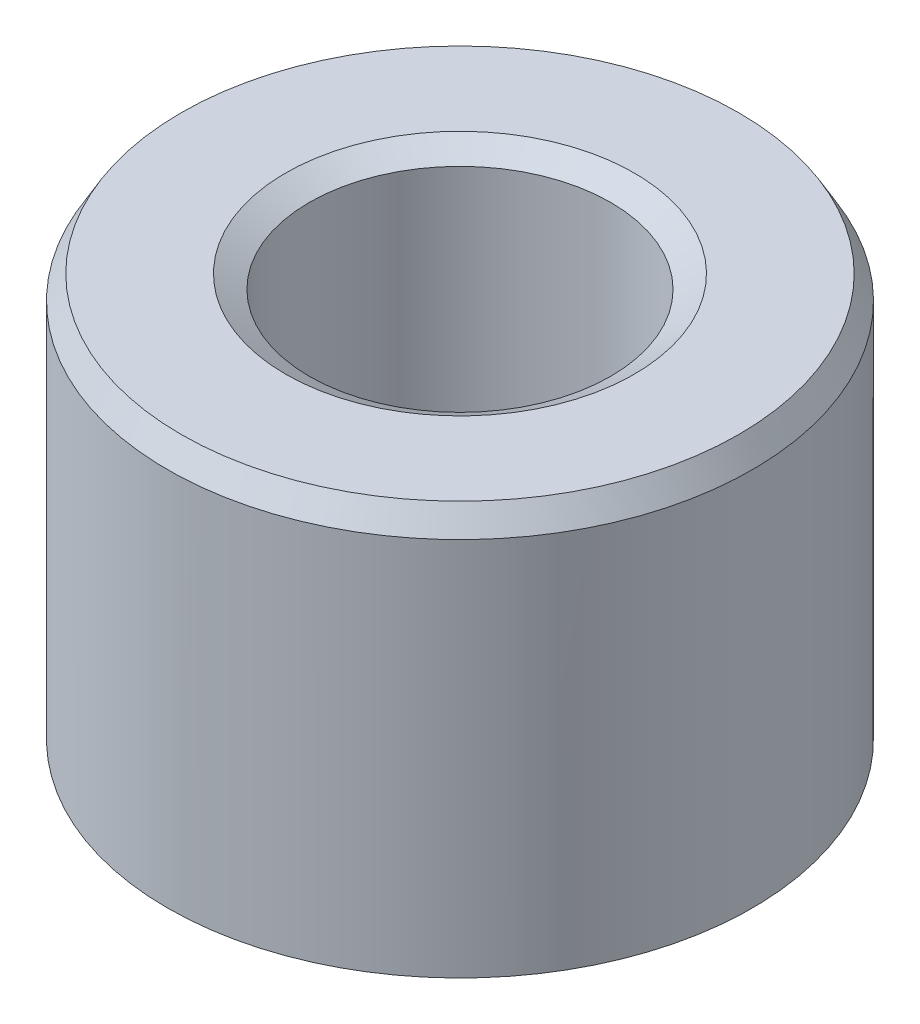
ISO-10303-21;
HEADER;
FILE_DESCRIPTION(('STEP AP214'),'2;1');
FILE_NAME('part.step','',(''),(''),'','','');
FILE_SCHEMA(('AUTOMOTIVE_DESIGN { 1 0 10303 214 1 1 1 1 }'));
ENDSEC;
DATA;
#1=APPLICATION_CONTEXT('core data for automotive mechanical design processes');
#2=APPLICATION_PROTOCOL_DEFINITION('international standard','automotive_design',2000,#1);
#3=PRODUCT_CONTEXT('',#1,'mechanical');
#4=PRODUCT('Part','Part','',(#3));
#5=PRODUCT_RELATED_PRODUCT_CATEGORY('part','',(#4));
#6=PRODUCT_DEFINITION_FORMATION('','',#4);
#7=PRODUCT_DEFINITION_CONTEXT('part definition',#1,'design');
#8=PRODUCT_DEFINITION('design','',#6,#7);
#9=PRODUCT_DEFINITION_SHAPE('','',#8);
#10=(LENGTH_UNIT() NAMED_UNIT(*) SI_UNIT(.MILLI.,.METRE.));
#11=(NAMED_UNIT(*) PLANE_ANGLE_UNIT() SI_UNIT($,.RADIAN.));
#12=(NAMED_UNIT(*) SI_UNIT($,.STERADIAN.) SOLID_ANGLE_UNIT());
#13=UNCERTAINTY_MEASURE_WITH_UNIT(LENGTH_MEASURE(1.E-05),#10,'distance_accuracy_value','');
#14=(GEOMETRIC_REPRESENTATION_CONTEXT(3) GLOBAL_UNCERTAINTY_ASSIGNED_CONTEXT((#13)) GLOBAL_UNIT_ASSIGNED_CONTEXT((#10,
#11,#12)) REPRESENTATION_CONTEXT('',''));
#15=CARTESIAN_POINT('',(0.,0.,0.));
#16=DIRECTION('',(0.,0.,1.));
#17=DIRECTION('',(1.,0.,0.));
#18=AXIS2_PLACEMENT_3D('',#15,#16,#17);
#19=CARTESIAN_POINT('',(0.,14.2592597923055,0.));
#20=DIRECTION('',(0.,-1.,0.));
#21=DIRECTION('',(0.,0.,-1.));
#22=AXIS2_PLACEMENT_3D('',#19,#20,#21);
#23=CYLINDRICAL_SURFACE('',#22,10.);
#24=CARTESIAN_POINT('',(0.,0.466748571769393,0.));
#25=DIRECTION('',(0.,1.,0.));
#26=DIRECTION('',(0.,0.,1.));
#27=AXIS2_PLACEMENT_3D('',#24,#25,#26);
#28=CIRCLE('',#27,10.);
#29=CARTESIAN_POINT('',(0.,0.466748571769392,-10.));
#30=VERTEX_POINT('',#29);
#31=EDGE_CURVE('E10',#30,#30,#28,.T.);
#32=CARTESIAN_POINT('',(0.,13.4508275516407,0.));
#33=DIRECTION('',(0.,1.,0.));
#34=DIRECTION('',(0.,0.,1.));
#35=AXIS2_PLACEMENT_3D('',#32,#33,#34);
#36=CIRCLE('',#35,10.);
#37=CARTESIAN_POINT('',(0.,13.4508275516407,-10.));
#38=VERTEX_POINT('',#37);
#39=EDGE_CURVE('E50',#38,#38,#36,.F.);
#40=CARTESIAN_POINT('',(0.,0.466748571769392,-10.));
#41=CARTESIAN_POINT('',(0.,0.601999394476385,-10.));
#42=CARTESIAN_POINT('',(0.,0.737250217183377,-10.));
#43=CARTESIAN_POINT('',(0.,1.00775186259736,-10.));
#44=CARTESIAN_POINT('',(0.,1.14300268530436,-10.));
#45=CARTESIAN_POINT('',(0.,1.41350433071834,-10.));
#46=CARTESIAN_POINT('',(0.,1.54875515342533,-10.));
#47=CARTESIAN_POINT('',(0.,1.81925679883932,-10.));
#48=CARTESIAN_POINT('',(0.,1.95450762154631,-10.));
#49=CARTESIAN_POINT('',(0.,2.2250092669603,-10.));
#50=CARTESIAN_POINT('',(0.,2.36026008966729,-10.));
#51=CARTESIAN_POINT('',(0.,2.63076173508128,-10.));
#52=CARTESIAN_POINT('',(0.,2.76601255778827,-10.));
#53=CARTESIAN_POINT('',(0.,3.03651420320225,-10.));
#54=CARTESIAN_POINT('',(0.,3.17176502590925,-10.));
#55=CARTESIAN_POINT('',(0.,3.44226667132323,-10.));
#56=CARTESIAN_POINT('',(0.,3.57751749403023,-10.));
#57=CARTESIAN_POINT('',(0.,3.84801913944421,-10.));
#58=CARTESIAN_POINT('',(0.,3.9832699621512,-10.));
#59=CARTESIAN_POINT('',(0.,4.25377160756519,-10.));
#60=CARTESIAN_POINT('',(0.,4.38902243027218,-10.));
#61=CARTESIAN_POINT('',(0.,4.65952407568617,-10.));
#62=CARTESIAN_POINT('',(0.,4.79477489839316,-10.));
#63=CARTESIAN_POINT('',(0.,5.06527654380714,-10.));
#64=CARTESIAN_POINT('',(0.,5.20052736651414,-10.));
#65=CARTESIAN_POINT('',(0.,5.47102901192812,-10.));
#66=CARTESIAN_POINT('',(0.,5.60627983463511,-10.));
#67=CARTESIAN_POINT('',(0.,5.8767814800491,-10.));
#68=CARTESIAN_POINT('',(0.,6.01203230275609,-10.));
#69=CARTESIAN_POINT('',(0.,6.28253394817008,-10.));
#70=CARTESIAN_POINT('',(0.,6.41778477087707,-10.));
#71=CARTESIAN_POINT('',(0.,6.68828641629106,-10.));
#72=CARTESIAN_POINT('',(0.,6.82353723899805,-10.));
#73=CARTESIAN_POINT('',(0.,7.09403888441203,-10.));
#74=CARTESIAN_POINT('',(0.,7.22928970711903,-10.));
#75=CARTESIAN_POINT('',(0.,7.49979135253301,-10.));
#76=CARTESIAN_POINT('',(0.,7.63504217524001,-10.));
#77=CARTESIAN_POINT('',(0.,7.90554382065399,-10.));
#78=CARTESIAN_POINT('',(0.,8.04079464336098,-10.));
#79=CARTESIAN_POINT('',(0.,8.31129628877497,-10.));
#80=CARTESIAN_POINT('',(0.,8.44654711148196,-10.));
#81=CARTESIAN_POINT('',(0.,8.71704875689595,-10.));
#82=CARTESIAN_POINT('',(0.,8.85229957960294,-10.));
#83=CARTESIAN_POINT('',(0.,9.12280122501693,-10.));
#84=CARTESIAN_POINT('',(0.,9.25805204772392,-10.));
#85=CARTESIAN_POINT('',(0.,9.5285536931379,-10.));
#86=CARTESIAN_POINT('',(0.,9.6638045158449,-10.));
#87=CARTESIAN_POINT('',(0.,9.93430616125888,-10.));
#88=CARTESIAN_POINT('',(0.,10.0695569839659,-10.));
#89=CARTESIAN_POINT('',(0.,10.3400586293799,-10.));
#90=CARTESIAN_POINT('',(0.,10.4753094520869,-10.));
#91=CARTESIAN_POINT('',(0.,10.7458110975008,-10.));
#92=CARTESIAN_POINT('',(0.,10.8810619202078,-10.));
#93=CARTESIAN_POINT('',(0.,11.1515635656218,-10.));
#94=CARTESIAN_POINT('',(0.,11.2868143883288,-10.));
#95=CARTESIAN_POINT('',(0.,11.5573160337428,-10.));
#96=CARTESIAN_POINT('',(0.,11.6925668564498,-10.));
#97=CARTESIAN_POINT('',(0.,11.9630685018638,-10.));
#98=CARTESIAN_POINT('',(0.,12.0983193245708,-10.));
#99=CARTESIAN_POINT('',(0.,12.3688209699847,-10.));
#100=CARTESIAN_POINT('',(0.,12.5040717926917,-10.));
#101=CARTESIAN_POINT('',(0.,12.7745734381057,-10.));
#102=CARTESIAN_POINT('',(0.,12.9098242608127,-10.));
#103=CARTESIAN_POINT('',(0.,13.1803259062267,-10.));
#104=CARTESIAN_POINT('',(0.,13.3155767289337,-10.));
#105=CARTESIAN_POINT('',(0.,13.4508275516407,-10.));
#106=B_SPLINE_CURVE_WITH_KNOTS('',3,(#40,#41,#42,#43,#44,#45,#46,#47,#48,#49,#50,#51,#52,#53,
#54,#55,#56,#57,#58,#59,#60,#61,#62,#63,#64,#65,#66,#67,#68,#69,#70,#71,#72,#73,#74,#75,#76,#77,
#78,#79,#80,#81,#82,#83,#84,#85,#86,#87,#88,#89,#90,#91,#92,#93,#94,#95,#96,#97,#98,#99,#100,
#101,#102,#103,#104,#105),.UNSPECIFIED.,.F.,.F.,(4,2,2,2,2,2,2,2,2,2,2,2,2,2,2,2,2,2,2,2,2,2,2,
2,2,2,2,2,2,2,2,2,4),(0.,0.405752468120978,0.811504936241957,1.21725740436293,1.62300987248391,
2.02876234060489,2.43451480872587,2.84026727684685,3.24601974496783,3.6517722130888,
4.05752468120978,4.46327714933076,4.86902961745174,5.27478208557272,5.68053455369369,
6.08628702181467,6.49203948993565,6.89779195805663,7.30354442617761,7.70929689429858,
8.11504936241956,8.52080183054054,8.92655429866152,9.3323067667825,9.73805923490348,
10.1438117030245,10.5495641711454,10.9553166392664,11.3610691073874,11.7668215755084,
12.1725740436293,12.5783265117503,12.9840789798713),.UNSPECIFIED.);
#107=EDGE_CURVE('BSEAM39',#30,#38,#106,.T.);
#108=ORIENTED_EDGE('',*,*,#31,.T.);
#109=ORIENTED_EDGE('',*,*,#39,.T.);
#110=ORIENTED_EDGE('',*,*,#107,.T.);
#111=ORIENTED_EDGE('',*,*,#107,.F.);
#112=EDGE_LOOP('',(#108,#110,#109,#111));
#113=FACE_BOUND('',#112,.T.);
#114=ADVANCED_FACE('F39',(#113),#23,.T.);
#115=CARTESIAN_POINT('',(0.,14.2592597923055,0.));
#116=DIRECTION('',(0.,1.,0.));
#117=DIRECTION('',(0.,0.,1.));
#118=AXIS2_PLACEMENT_3D('',#115,#116,#117);
#119=PLANE('',#118);
#120=CARTESIAN_POINT('',(0.,14.2592597923055,0.));
#121=DIRECTION('',(0.,1.,0.));
#122=DIRECTION('',(0.,0.,1.));
#123=AXIS2_PLACEMENT_3D('',#120,#121,#122);
#124=CIRCLE('',#123,5.96179652687227);
#125=CARTESIAN_POINT('',(0.,14.2592597923055,5.96179652687227));
#126=VERTEX_POINT('',#125);
#127=EDGE_CURVE('E58',#126,#126,#124,.F.);
#128=ORIENTED_EDGE('',*,*,#127,.T.);
#129=EDGE_LOOP('',(#128));
#130=FACE_BOUND('',#129,.T.);
#131=CARTESIAN_POINT('',(0.,14.2592597923055,0.));
#132=DIRECTION('',(0.,1.,0.));
#133=DIRECTION('',(0.,0.,1.));
#134=AXIS2_PLACEMENT_3D('',#131,#132,#133);
#135=CIRCLE('',#134,9.53325142823064);
#136=CARTESIAN_POINT('',(0.,14.2592597923055,9.53325142823064));
#137=VERTEX_POINT('',#136);
#138=EDGE_CURVE('E61',#137,#137,#135,.T.);
#139=ORIENTED_EDGE('',*,*,#138,.T.);
#140=EDGE_LOOP('',(#139));
#141=FACE_BOUND('',#140,.T.);
#142=ADVANCED_FACE('F88',(#130,#141),#119,.T.);
#143=CARTESIAN_POINT('',(0.,0.,0.));
#144=DIRECTION('',(0.,1.,0.));
#145=DIRECTION('',(0.,0.,1.));
#146=AXIS2_PLACEMENT_3D('',#143,#144,#145);
#147=PLANE('',#146);
#148=CARTESIAN_POINT('',(0.,0.,0.));
#149=DIRECTION('',(0.,1.,0.));
#150=DIRECTION('',(0.,0.,1.));
#151=AXIS2_PLACEMENT_3D('',#148,#149,#150);
#152=CIRCLE('',#151,5.62011285797684);
#153=CARTESIAN_POINT('',(0.,0.,5.62011285797684));
#154=VERTEX_POINT('',#153);
#155=EDGE_CURVE('E51',#154,#154,#152,.T.);
#156=ORIENTED_EDGE('',*,*,#155,.T.);
#157=EDGE_LOOP('',(#156));
#158=FACE_BOUND('',#157,.T.);
#159=CARTESIAN_POINT('',(0.,0.,0.));
#160=DIRECTION('',(0.,1.,0.));
#161=DIRECTION('',(0.,0.,1.));
#162=AXIS2_PLACEMENT_3D('',#159,#160,#161);
#163=CIRCLE('',#162,9.19156775933519);
#164=CARTESIAN_POINT('',(0.,0.,9.19156775933519));
#165=VERTEX_POINT('',#164);
#166=EDGE_CURVE('E54',#165,#165,#163,.F.);
#167=ORIENTED_EDGE('',*,*,#166,.T.);
#168=EDGE_LOOP('',(#167));
#169=FACE_BOUND('',#168,.T.);
#170=ADVANCED_FACE('F83',(#158,#169),#147,.F.);
#171=CARTESIAN_POINT('',(0.,14.2592597923055,0.));
#172=DIRECTION('',(0.,-1.,0.));
#173=DIRECTION('',(0.,0.,-1.));
#174=AXIS2_PLACEMENT_3D('',#171,#172,#173);
#175=CYLINDRICAL_SURFACE('',#174,5.15336428620746);
#176=CARTESIAN_POINT('',(0.,13.7925112205361,0.));
#177=DIRECTION('',(0.,1.,0.));
#178=DIRECTION('',(0.,0.,1.));
#179=AXIS2_PLACEMENT_3D('',#176,#177,#178);
#180=CIRCLE('',#179,5.15336428620746);
#181=CARTESIAN_POINT('',(0.,13.7925112205361,-5.15336428620746));
#182=VERTEX_POINT('',#181);
#183=EDGE_CURVE('E67',#182,#182,#180,.T.);
#184=CARTESIAN_POINT('',(0.,0.80843224066479,0.));
#185=DIRECTION('',(0.,1.,0.));
#186=DIRECTION('',(0.,0.,1.));
#187=AXIS2_PLACEMENT_3D('',#184,#185,#186);
#188=CIRCLE('',#187,5.15336428620746);
#189=CARTESIAN_POINT('',(0.,0.808432240664788,-5.15336428620746));
#190=VERTEX_POINT('',#189);
#191=EDGE_CURVE('E69',#190,#190,#188,.F.);
#192=CARTESIAN_POINT('',(0.,13.7925112205361,-5.15336428620746));
#193=CARTESIAN_POINT('',(0.,13.6572603978291,-5.15336428620746));
#194=CARTESIAN_POINT('',(0.,13.5220095751221,-5.15336428620746));
#195=CARTESIAN_POINT('',(0.,13.2515079297081,-5.15336428620746));
#196=CARTESIAN_POINT('',(0.,13.1162571070011,-5.15336428620746));
#197=CARTESIAN_POINT('',(0.,12.8457554615871,-5.15336428620746));
#198=CARTESIAN_POINT('',(0.,12.7105046388801,-5.15336428620746));
#199=CARTESIAN_POINT('',(0.,12.4400029934661,-5.15336428620746));
#200=CARTESIAN_POINT('',(0.,12.3047521707591,-5.15336428620746));
#201=CARTESIAN_POINT('',(0.,12.0342505253452,-5.15336428620746));
#202=CARTESIAN_POINT('',(0.,11.8989997026382,-5.15336428620746));
#203=CARTESIAN_POINT('',(0.,11.6284980572242,-5.15336428620746));
#204=CARTESIAN_POINT('',(0.,11.4932472345172,-5.15336428620746));
#205=CARTESIAN_POINT('',(0.,11.2227455891032,-5.15336428620746));
#206=CARTESIAN_POINT('',(0.,11.0874947663962,-5.15336428620746));
#207=CARTESIAN_POINT('',(0.,10.8169931209822,-5.15336428620746));
#208=CARTESIAN_POINT('',(0.,10.6817422982752,-5.15336428620746));
#209=CARTESIAN_POINT('',(0.,10.4112406528612,-5.15336428620746));
#210=CARTESIAN_POINT('',(0.,10.2759898301543,-5.15336428620746));
#211=CARTESIAN_POINT('',(0.,10.0054881847403,-5.15336428620746));
#212=CARTESIAN_POINT('',(0.,9.87023736203328,-5.15336428620746));
#213=CARTESIAN_POINT('',(0.,9.59973571661929,-5.15336428620746));
#214=CARTESIAN_POINT('',(0.,9.4644848939123,-5.15336428620746));
#215=CARTESIAN_POINT('',(0.,9.19398324849832,-5.15336428620746));
#216=CARTESIAN_POINT('',(0.,9.05873242579132,-5.15336428620746));
#217=CARTESIAN_POINT('',(0.,8.78823078037734,-5.15336428620746));
#218=CARTESIAN_POINT('',(0.,8.65297995767035,-5.15336428620746));
#219=CARTESIAN_POINT('',(0.,8.38247831225636,-5.15336428620746));
#220=CARTESIAN_POINT('',(0.,8.24722748954937,-5.15336428620746));
#221=CARTESIAN_POINT('',(0.,7.97672584413539,-5.15336428620746));
#222=CARTESIAN_POINT('',(0.,7.84147502142839,-5.15336428620746));
#223=CARTESIAN_POINT('',(0.,7.57097337601441,-5.15336428620746));
#224=CARTESIAN_POINT('',(0.,7.43572255330742,-5.15336428620746));
#225=CARTESIAN_POINT('',(0.,7.16522090789343,-5.15336428620746));
#226=CARTESIAN_POINT('',(0.,7.02997008518644,-5.15336428620746));
#227=CARTESIAN_POINT('',(0.,6.75946843977245,-5.15336428620746));
#228=CARTESIAN_POINT('',(0.,6.62421761706546,-5.15336428620746));
#229=CARTESIAN_POINT('',(0.,6.35371597165148,-5.15336428620746));
#230=CARTESIAN_POINT('',(0.,6.21846514894448,-5.15336428620746));
#231=CARTESIAN_POINT('',(0.,5.9479635035305,-5.15336428620746));
#232=CARTESIAN_POINT('',(0.,5.81271268082351,-5.15336428620746));
#233=CARTESIAN_POINT('',(0.,5.54221103540952,-5.15336428620746));
#234=CARTESIAN_POINT('',(0.,5.40696021270253,-5.15336428620746));
#235=CARTESIAN_POINT('',(0.,5.13645856728855,-5.15336428620746));
#236=CARTESIAN_POINT('',(0.,5.00120774458155,-5.15336428620746));
#237=CARTESIAN_POINT('',(0.,4.73070609916757,-5.15336428620746));
#238=CARTESIAN_POINT('',(0.,4.59545527646057,-5.15336428620746));
#239=CARTESIAN_POINT('',(0.,4.32495363104659,-5.15336428620746));
#240=CARTESIAN_POINT('',(0.,4.1897028083396,-5.15336428620746));
#241=CARTESIAN_POINT('',(0.,3.91920116292561,-5.15336428620746));
#242=CARTESIAN_POINT('',(0.,3.78395034021862,-5.15336428620746));
#243=CARTESIAN_POINT('',(0.,3.51344869480464,-5.15336428620746));
#244=CARTESIAN_POINT('',(0.,3.37819787209764,-5.15336428620746));
#245=CARTESIAN_POINT('',(0.,3.10769622668366,-5.15336428620746));
#246=CARTESIAN_POINT('',(0.,2.97244540397667,-5.15336428620746));
#247=CARTESIAN_POINT('',(0.,2.70194375856268,-5.15336428620746));
#248=CARTESIAN_POINT('',(0.,2.56669293585569,-5.15336428620746));
#249=CARTESIAN_POINT('',(0.,2.2961912904417,-5.15336428620746));
#250=CARTESIAN_POINT('',(0.,2.16094046773471,-5.15336428620746));
#251=CARTESIAN_POINT('',(0.,1.89043882232073,-5.15336428620746));
#252=CARTESIAN_POINT('',(0.,1.75518799961373,-5.15336428620746));
#253=CARTESIAN_POINT('',(0.,1.48468635419975,-5.15336428620746));
#254=CARTESIAN_POINT('',(0.,1.34943553149276,-5.15336428620746));
#255=CARTESIAN_POINT('',(0.,1.07893388607877,-5.15336428620746));
#256=CARTESIAN_POINT('',(0.,0.94368306337178,-5.15336428620746));
#257=CARTESIAN_POINT('',(0.,0.808432240664788,-5.15336428620746));
#258=B_SPLINE_CURVE_WITH_KNOTS('',3,(#192,#193,#194,#195,#196,#197,#198,#199,#200,#201,#202,
#203,#204,#205,#206,#207,#208,#209,#210,#211,#212,#213,#214,#215,#216,#217,#218,#219,#220,#221,
#222,#223,#224,#225,#226,#227,#228,#229,#230,#231,#232,#233,#234,#235,#236,#237,#238,#239,#240,
#241,#242,#243,#244,#245,#246,#247,#248,#249,#250,#251,#252,#253,#254,#255,#256,#257),
.UNSPECIFIED.,.F.,.F.,(4,2,2,2,2,2,2,2,2,2,2,2,2,2,2,2,2,2,2,2,2,2,2,2,2,2,2,2,2,2,2,2,4),(0.,
0.405752468120978,0.811504936241955,1.21725740436293,1.62300987248391,2.02876234060489,
2.43451480872586,2.84026727684684,3.24601974496782,3.6517722130888,4.05752468120977,
4.46327714933075,4.86902961745173,5.27478208557271,5.68053455369368,6.08628702181466,
6.49203948993564,6.89779195805661,7.30354442617759,7.70929689429857,8.11504936241955,
8.52080183054052,8.9265542986615,9.33230676678248,9.73805923490345,10.1438117030244,
10.5495641711454,10.9553166392664,11.3610691073874,11.7668215755083,12.1725740436293,
12.5783265117503,12.9840789798713),.UNSPECIFIED.);
#259=EDGE_CURVE('BSEAM71',#182,#190,#258,.T.);
#260=ORIENTED_EDGE('',*,*,#183,.T.);
#261=ORIENTED_EDGE('',*,*,#191,.T.);
#262=ORIENTED_EDGE('',*,*,#259,.T.);
#263=ORIENTED_EDGE('',*,*,#259,.F.);
#264=EDGE_LOOP('',(#260,#262,#261,#263));
#265=FACE_BOUND('',#264,.T.);
#266=ADVANCED_FACE('F71',(#265),#175,.F.);
#267=CARTESIAN_POINT('',(0.,13.7925112205361,0.));
#268=DIRECTION('',(0.,1.,0.));
#269=DIRECTION('',(0.,0.,1.));
#270=AXIS2_PLACEMENT_3D('',#267,#268,#269);
#271=CONICAL_SURFACE('',#270,5.15336428620746,1.04719755119661);
#272=ORIENTED_EDGE('',*,*,#127,.F.);
#273=EDGE_LOOP('',(#272));
#274=FACE_BOUND('',#273,.T.);
#275=ORIENTED_EDGE('',*,*,#183,.F.);
#276=EDGE_LOOP('',(#275));
#277=FACE_BOUND('',#276,.T.);
#278=ADVANCED_FACE('F77',(#274,#277),#271,.F.);
#279=CARTESIAN_POINT('',(0.,0.,0.));
#280=DIRECTION('',(0.,-1.,0.));
#281=DIRECTION('',(0.,0.,-1.));
#282=AXIS2_PLACEMENT_3D('',#279,#280,#281);
#283=CONICAL_SURFACE('',#282,5.62011285797684,0.523598775598294);
#284=ORIENTED_EDGE('',*,*,#191,.F.);
#285=EDGE_LOOP('',(#284));
#286=FACE_BOUND('',#285,.T.);
#287=ORIENTED_EDGE('',*,*,#155,.F.);
#288=EDGE_LOOP('',(#287));
#289=FACE_BOUND('',#288,.T.);
#290=ADVANCED_FACE('F73',(#286,#289),#283,.F.);
#291=CARTESIAN_POINT('',(0.,0.466748571769393,0.));
#292=DIRECTION('',(0.,1.,0.));
#293=DIRECTION('',(0.,0.,1.));
#294=AXIS2_PLACEMENT_3D('',#291,#292,#293);
#295=CONICAL_SURFACE('',#294,10.,1.0471975511966);
#296=ORIENTED_EDGE('',*,*,#166,.F.);
#297=EDGE_LOOP('',(#296));
#298=FACE_BOUND('',#297,.T.);
#299=ORIENTED_EDGE('',*,*,#31,.F.);
#300=EDGE_LOOP('',(#299));
#301=FACE_BOUND('',#300,.T.);
#302=ADVANCED_FACE('F76',(#298,#301),#295,.T.);
#303=CARTESIAN_POINT('',(0.,14.2592597923055,0.));
#304=DIRECTION('',(0.,-1.,0.));
#305=DIRECTION('',(0.,0.,-1.));
#306=AXIS2_PLACEMENT_3D('',#303,#304,#305);
#307=CONICAL_SURFACE('',#306,9.53325142823064,0.523598775598292);
#308=ORIENTED_EDGE('',*,*,#39,.F.);
#309=EDGE_LOOP('',(#308));
#310=FACE_BOUND('',#309,.T.);
#311=ORIENTED_EDGE('',*,*,#138,.F.);
#312=EDGE_LOOP('',(#311));
#313=FACE_BOUND('',#312,.T.);
#314=ADVANCED_FACE('F45',(#310,#313),#307,.T.);
#315=CLOSED_SHELL('',(#114,#142,#170,#266,#278,#290,#302,#314));
#316=MANIFOLD_SOLID_BREP('B2',#315);
#317=ADVANCED_BREP_SHAPE_REPRESENTATION('',(#18,#316),#14);
#318=SHAPE_DEFINITION_REPRESENTATION(#9,#317);
ENDSEC;
END-ISO-10303-21;
